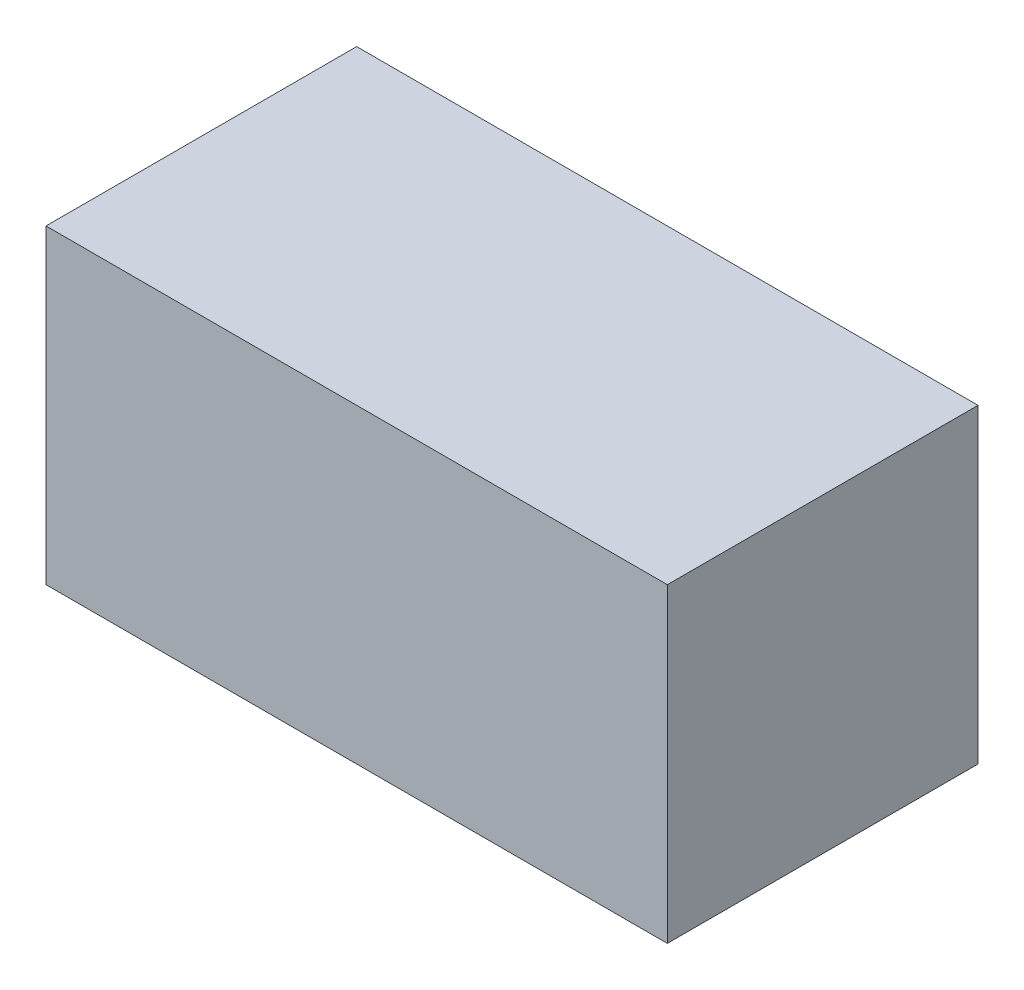
ISO-10303-21;
HEADER;
FILE_DESCRIPTION(('STEP AP214'),'2;1');
FILE_NAME('part.step','',(''),(''),'','','');
FILE_SCHEMA(('AUTOMOTIVE_DESIGN { 1 0 10303 214 1 1 1 1 }'));
ENDSEC;
DATA;
#1=APPLICATION_CONTEXT('core data for automotive mechanical design processes');
#2=APPLICATION_PROTOCOL_DEFINITION('international standard','automotive_design',2000,#1);
#3=PRODUCT_CONTEXT('',#1,'mechanical');
#4=PRODUCT('Part','Part','',(#3));
#5=PRODUCT_RELATED_PRODUCT_CATEGORY('part','',(#4));
#6=PRODUCT_DEFINITION_FORMATION('','',#4);
#7=PRODUCT_DEFINITION_CONTEXT('part definition',#1,'design');
#8=PRODUCT_DEFINITION('design','',#6,#7);
#9=PRODUCT_DEFINITION_SHAPE('','',#8);
#10=(LENGTH_UNIT() NAMED_UNIT(*) SI_UNIT(.MILLI.,.METRE.));
#11=(NAMED_UNIT(*) PLANE_ANGLE_UNIT() SI_UNIT($,.RADIAN.));
#12=(NAMED_UNIT(*) SI_UNIT($,.STERADIAN.) SOLID_ANGLE_UNIT());
#13=UNCERTAINTY_MEASURE_WITH_UNIT(LENGTH_MEASURE(1.E-05),#10,'distance_accuracy_value','');
#14=(GEOMETRIC_REPRESENTATION_CONTEXT(3) GLOBAL_UNCERTAINTY_ASSIGNED_CONTEXT((#13)) GLOBAL_UNIT_ASSIGNED_CONTEXT((#10,
#11,#12)) REPRESENTATION_CONTEXT('',''));
#15=CARTESIAN_POINT('',(0.,0.,0.));
#16=DIRECTION('',(0.,0.,1.));
#17=DIRECTION('',(1.,0.,0.));
#18=AXIS2_PLACEMENT_3D('',#15,#16,#17);
#19=CARTESIAN_POINT('',(-10.,10.,-5.));
#20=DIRECTION('',(1.,0.,0.));
#21=DIRECTION('',(0.,0.,-1.));
#22=AXIS2_PLACEMENT_3D('',#19,#20,#21);
#23=PLANE('',#22);
#24=DIRECTION('',(0.,0.,1.));
#25=VECTOR('',#24,1.);
#26=CARTESIAN_POINT('',(-10.,0.,-5.));
#27=LINE('',#26,#25);
#28=CARTESIAN_POINT('',(-10.,0.,-5.));
#29=VERTEX_POINT('',#28);
#30=CARTESIAN_POINT('',(-10.,0.,5.));
#31=VERTEX_POINT('',#30);
#32=EDGE_CURVE('E96',#29,#31,#27,.T.);
#33=ORIENTED_EDGE('',*,*,#32,.T.);
#34=DIRECTION('',(0.,-1.,0.));
#35=VECTOR('',#34,1.);
#36=CARTESIAN_POINT('',(-10.,10.,5.));
#37=LINE('',#36,#35);
#38=CARTESIAN_POINT('',(-10.,10.,5.));
#39=VERTEX_POINT('',#38);
#40=EDGE_CURVE('E11',#39,#31,#37,.T.);
#41=ORIENTED_EDGE('',*,*,#40,.F.);
#42=DIRECTION('',(0.,0.,1.));
#43=VECTOR('',#42,1.);
#44=CARTESIAN_POINT('',(-10.,10.,-5.));
#45=LINE('',#44,#43);
#46=CARTESIAN_POINT('',(-10.,10.,-5.));
#47=VERTEX_POINT('',#46);
#48=EDGE_CURVE('E84',#47,#39,#45,.T.);
#49=ORIENTED_EDGE('',*,*,#48,.F.);
#50=DIRECTION('',(0.,-1.,0.));
#51=VECTOR('',#50,1.);
#52=CARTESIAN_POINT('',(-10.,10.,-5.));
#53=LINE('',#52,#51);
#54=EDGE_CURVE('E92',#47,#29,#53,.T.);
#55=ORIENTED_EDGE('',*,*,#54,.T.);
#56=EDGE_LOOP('',(#33,#41,#49,#55));
#57=FACE_BOUND('',#56,.T.);
#58=ADVANCED_FACE('F33',(#57),#23,.F.);
#59=CARTESIAN_POINT('',(-10.,10.,5.));
#60=DIRECTION('',(0.,0.,-1.));
#61=DIRECTION('',(-1.,0.,0.));
#62=AXIS2_PLACEMENT_3D('',#59,#60,#61);
#63=PLANE('',#62);
#64=DIRECTION('',(1.,0.,0.));
#65=VECTOR('',#64,1.);
#66=CARTESIAN_POINT('',(-10.,0.,5.));
#67=LINE('',#66,#65);
#68=CARTESIAN_POINT('',(10.,0.,5.));
#69=VERTEX_POINT('',#68);
#70=EDGE_CURVE('E88',#31,#69,#67,.T.);
#71=ORIENTED_EDGE('',*,*,#70,.T.);
#72=DIRECTION('',(0.,-1.,0.));
#73=VECTOR('',#72,1.);
#74=CARTESIAN_POINT('',(10.,10.,5.));
#75=LINE('',#74,#73);
#76=CARTESIAN_POINT('',(10.,10.,5.));
#77=VERTEX_POINT('',#76);
#78=EDGE_CURVE('E41',#77,#69,#75,.T.);
#79=ORIENTED_EDGE('',*,*,#78,.F.);
#80=DIRECTION('',(1.,0.,0.));
#81=VECTOR('',#80,1.);
#82=CARTESIAN_POINT('',(-10.,10.,5.));
#83=LINE('',#82,#81);
#84=EDGE_CURVE('E79',#39,#77,#83,.T.);
#85=ORIENTED_EDGE('',*,*,#84,.F.);
#86=ORIENTED_EDGE('',*,*,#40,.T.);
#87=EDGE_LOOP('',(#71,#79,#85,#86));
#88=FACE_BOUND('',#87,.T.);
#89=ADVANCED_FACE('F87',(#88),#63,.F.);
#90=CARTESIAN_POINT('',(10.,10.,-5.));
#91=DIRECTION('',(-1.,0.,0.));
#92=DIRECTION('',(0.,0.,1.));
#93=AXIS2_PLACEMENT_3D('',#90,#91,#92);
#94=PLANE('',#93);
#95=DIRECTION('',(0.,0.,-1.));
#96=VECTOR('',#95,1.);
#97=CARTESIAN_POINT('',(10.,0.,-5.));
#98=LINE('',#97,#96);
#99=CARTESIAN_POINT('',(10.,0.,-5.));
#100=VERTEX_POINT('',#99);
#101=EDGE_CURVE('E66',#69,#100,#98,.T.);
#102=ORIENTED_EDGE('',*,*,#101,.T.);
#103=DIRECTION('',(0.,-1.,0.));
#104=VECTOR('',#103,1.);
#105=CARTESIAN_POINT('',(10.,10.,-5.));
#106=LINE('',#105,#104);
#107=CARTESIAN_POINT('',(10.,10.,-5.));
#108=VERTEX_POINT('',#107);
#109=EDGE_CURVE('E89',#108,#100,#106,.T.);
#110=ORIENTED_EDGE('',*,*,#109,.F.);
#111=DIRECTION('',(0.,0.,-1.));
#112=VECTOR('',#111,1.);
#113=CARTESIAN_POINT('',(10.,10.,-5.));
#114=LINE('',#113,#112);
#115=EDGE_CURVE('E82',#77,#108,#114,.T.);
#116=ORIENTED_EDGE('',*,*,#115,.F.);
#117=ORIENTED_EDGE('',*,*,#78,.T.);
#118=EDGE_LOOP('',(#102,#110,#116,#117));
#119=FACE_BOUND('',#118,.T.);
#120=ADVANCED_FACE('F90',(#119),#94,.F.);
#121=CARTESIAN_POINT('',(-10.,10.,-5.));
#122=DIRECTION('',(0.,0.,1.));
#123=DIRECTION('',(1.,0.,0.));
#124=AXIS2_PLACEMENT_3D('',#121,#122,#123);
#125=PLANE('',#124);
#126=DIRECTION('',(-1.,0.,0.));
#127=VECTOR('',#126,1.);
#128=CARTESIAN_POINT('',(-10.,0.,-5.));
#129=LINE('',#128,#127);
#130=EDGE_CURVE('E72',#100,#29,#129,.T.);
#131=ORIENTED_EDGE('',*,*,#130,.T.);
#132=ORIENTED_EDGE('',*,*,#54,.F.);
#133=DIRECTION('',(-1.,0.,0.));
#134=VECTOR('',#133,1.);
#135=CARTESIAN_POINT('',(-10.,10.,-5.));
#136=LINE('',#135,#134);
#137=EDGE_CURVE('E49',#108,#47,#136,.T.);
#138=ORIENTED_EDGE('',*,*,#137,.F.);
#139=ORIENTED_EDGE('',*,*,#109,.T.);
#140=EDGE_LOOP('',(#131,#132,#138,#139));
#141=FACE_BOUND('',#140,.T.);
#142=ADVANCED_FACE('F103',(#141),#125,.F.);
#143=CARTESIAN_POINT('',(0.,10.,0.));
#144=DIRECTION('',(0.,1.,0.));
#145=DIRECTION('',(0.,0.,1.));
#146=AXIS2_PLACEMENT_3D('',#143,#144,#145);
#147=PLANE('',#146);
#148=ORIENTED_EDGE('',*,*,#48,.T.);
#149=ORIENTED_EDGE('',*,*,#84,.T.);
#150=ORIENTED_EDGE('',*,*,#115,.T.);
#151=ORIENTED_EDGE('',*,*,#137,.T.);
#152=EDGE_LOOP('',(#148,#149,#150,#151));
#153=FACE_BOUND('',#152,.T.);
#154=ADVANCED_FACE('F80',(#153),#147,.T.);
#155=CARTESIAN_POINT('',(0.,0.,0.));
#156=DIRECTION('',(0.,1.,0.));
#157=DIRECTION('',(0.,0.,1.));
#158=AXIS2_PLACEMENT_3D('',#155,#156,#157);
#159=PLANE('',#158);
#160=ORIENTED_EDGE('',*,*,#32,.F.);
#161=ORIENTED_EDGE('',*,*,#130,.F.);
#162=ORIENTED_EDGE('',*,*,#101,.F.);
#163=ORIENTED_EDGE('',*,*,#70,.F.);
#164=EDGE_LOOP('',(#160,#161,#162,#163));
#165=FACE_BOUND('',#164,.T.);
#166=ADVANCED_FACE('F106',(#165),#159,.F.);
#167=CLOSED_SHELL('',(#58,#89,#120,#142,#154,#166));
#168=MANIFOLD_SOLID_BREP('B2',#167);
#169=ADVANCED_BREP_SHAPE_REPRESENTATION('',(#18,#168),#14);
#170=SHAPE_DEFINITION_REPRESENTATION(#9,#169);
ENDSEC;
END-ISO-10303-21;
